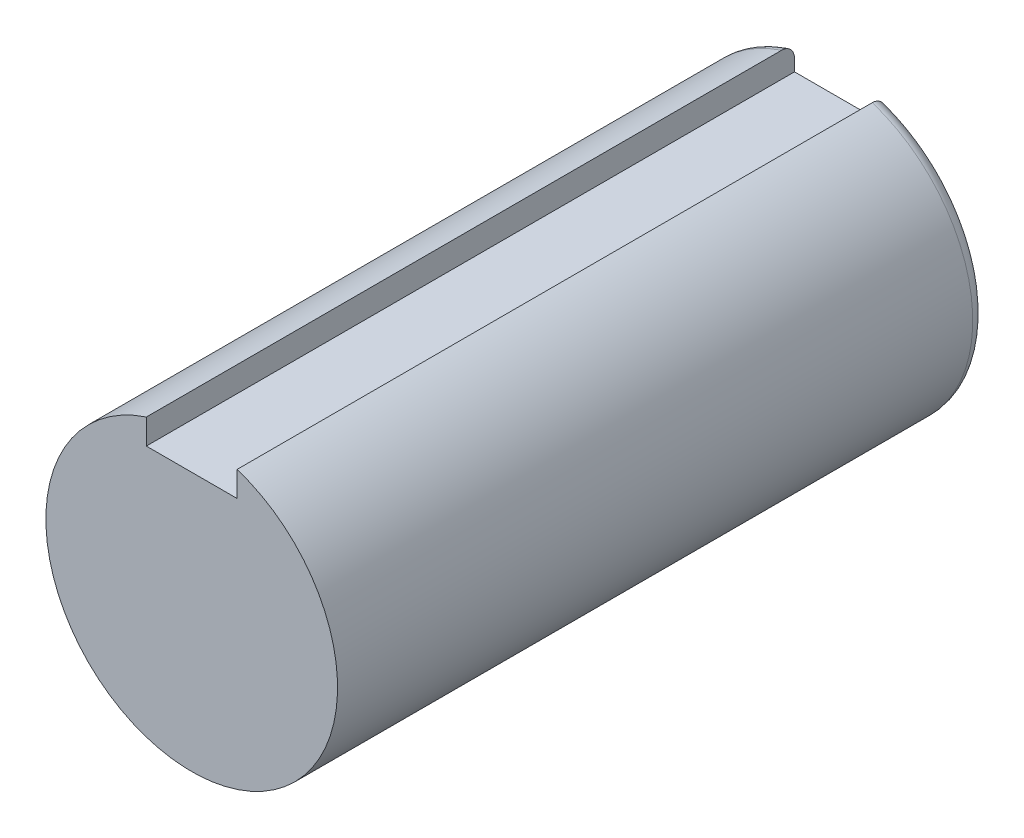
ISO-10303-21;
HEADER;
FILE_DESCRIPTION(('STEP AP214'),'2;1');
FILE_NAME('part.step','',(''),(''),'','','');
FILE_SCHEMA(('AUTOMOTIVE_DESIGN { 1 0 10303 214 1 1 1 1 }'));
ENDSEC;
DATA;
#1=APPLICATION_CONTEXT('core data for automotive mechanical design processes');
#2=APPLICATION_PROTOCOL_DEFINITION('international standard','automotive_design',2000,#1);
#3=PRODUCT_CONTEXT('',#1,'mechanical');
#4=PRODUCT('Part','Part','',(#3));
#5=PRODUCT_RELATED_PRODUCT_CATEGORY('part','',(#4));
#6=PRODUCT_DEFINITION_FORMATION('','',#4);
#7=PRODUCT_DEFINITION_CONTEXT('part definition',#1,'design');
#8=PRODUCT_DEFINITION('design','',#6,#7);
#9=PRODUCT_DEFINITION_SHAPE('','',#8);
#10=(LENGTH_UNIT() NAMED_UNIT(*) SI_UNIT(.MILLI.,.METRE.));
#11=(NAMED_UNIT(*) PLANE_ANGLE_UNIT() SI_UNIT($,.RADIAN.));
#12=(NAMED_UNIT(*) SI_UNIT($,.STERADIAN.) SOLID_ANGLE_UNIT());
#13=UNCERTAINTY_MEASURE_WITH_UNIT(LENGTH_MEASURE(1.E-05),#10,'distance_accuracy_value','');
#14=(GEOMETRIC_REPRESENTATION_CONTEXT(3) GLOBAL_UNCERTAINTY_ASSIGNED_CONTEXT((#13)) GLOBAL_UNIT_ASSIGNED_CONTEXT((#10,
#11,#12)) REPRESENTATION_CONTEXT('',''));
#15=CARTESIAN_POINT('',(0.,0.,0.));
#16=DIRECTION('',(0.,0.,1.));
#17=DIRECTION('',(1.,0.,0.));
#18=AXIS2_PLACEMENT_3D('',#15,#16,#17);
#19=CARTESIAN_POINT('',(0.,0.,100.));
#20=DIRECTION('',(0.,0.,-1.));
#21=DIRECTION('',(-1.,0.,0.));
#22=AXIS2_PLACEMENT_3D('',#19,#20,#21);
#23=CYLINDRICAL_SURFACE('',#22,22.5);
#24=DIRECTION('',(0.,0.,-1.));
#25=VECTOR('',#24,1.);
#26=CARTESIAN_POINT('',(-7.,21.3834047803431,100.));
#27=LINE('',#26,#25);
#28=CARTESIAN_POINT('',(-7.,21.3834047803431,100.));
#29=VERTEX_POINT('',#28);
#30=CARTESIAN_POINT('',(-7.,21.3834047803431,2.));
#31=VERTEX_POINT('',#30);
#32=EDGE_CURVE('E128',#29,#31,#27,.T.);
#33=ORIENTED_EDGE('',*,*,#32,.T.);
#34=CARTESIAN_POINT('',(0.,0.,2.));
#35=DIRECTION('',(0.,0.,1.));
#36=DIRECTION('',(1.,0.,0.));
#37=AXIS2_PLACEMENT_3D('',#34,#35,#36);
#38=CIRCLE('',#37,22.5);
#39=CARTESIAN_POINT('',(7.,21.3834047803431,2.));
#40=VERTEX_POINT('',#39);
#41=EDGE_CURVE('E140',#31,#40,#38,.T.);
#42=ORIENTED_EDGE('',*,*,#41,.T.);
#43=DIRECTION('',(0.,0.,-1.));
#44=VECTOR('',#43,1.);
#45=CARTESIAN_POINT('',(7.,21.3834047803431,100.));
#46=LINE('',#45,#44);
#47=CARTESIAN_POINT('',(7.,21.3834047803431,100.));
#48=VERTEX_POINT('',#47);
#49=EDGE_CURVE('E133',#40,#48,#46,.F.);
#50=ORIENTED_EDGE('',*,*,#49,.T.);
#51=CARTESIAN_POINT('',(0.,0.,100.));
#52=DIRECTION('',(0.,0.,1.));
#53=DIRECTION('',(1.,0.,0.));
#54=AXIS2_PLACEMENT_3D('',#51,#52,#53);
#55=CIRCLE('',#54,22.5);
#56=EDGE_CURVE('E115',#29,#48,#55,.T.);
#57=ORIENTED_EDGE('',*,*,#56,.F.);
#58=EDGE_LOOP('',(#33,#42,#50,#57));
#59=FACE_BOUND('',#58,.T.);
#60=ADVANCED_FACE('F39',(#59),#23,.T.);
#61=CARTESIAN_POINT('',(0.,0.,100.));
#62=DIRECTION('',(0.,0.,1.));
#63=DIRECTION('',(1.,0.,0.));
#64=AXIS2_PLACEMENT_3D('',#61,#62,#63);
#65=PLANE('',#64);
#66=DIRECTION('',(0.,-1.,0.));
#67=VECTOR('',#66,1.);
#68=CARTESIAN_POINT('',(7.,25.3009858484922,100.));
#69=LINE('',#68,#67);
#70=CARTESIAN_POINT('',(7.,17.5,100.));
#71=VERTEX_POINT('',#70);
#72=EDGE_CURVE('E95',#48,#71,#69,.T.);
#73=ORIENTED_EDGE('',*,*,#72,.T.);
#74=DIRECTION('',(-1.,0.,0.));
#75=VECTOR('',#74,1.);
#76=CARTESIAN_POINT('',(7.,17.5,100.));
#77=LINE('',#76,#75);
#78=CARTESIAN_POINT('',(-7.,17.5,100.));
#79=VERTEX_POINT('',#78);
#80=EDGE_CURVE('E106',#71,#79,#77,.T.);
#81=ORIENTED_EDGE('',*,*,#80,.T.);
#82=DIRECTION('',(0.,1.,0.));
#83=VECTOR('',#82,1.);
#84=CARTESIAN_POINT('',(-7.,25.3009858484922,100.));
#85=LINE('',#84,#83);
#86=EDGE_CURVE('E103',#79,#29,#85,.T.);
#87=ORIENTED_EDGE('',*,*,#86,.T.);
#88=ORIENTED_EDGE('',*,*,#56,.T.);
#89=EDGE_LOOP('',(#73,#81,#87,#88));
#90=FACE_BOUND('',#89,.T.);
#91=ADVANCED_FACE('F113',(#90),#65,.T.);
#92=CARTESIAN_POINT('',(0.,0.,0.));
#93=DIRECTION('',(0.,0.,1.));
#94=DIRECTION('',(1.,0.,0.));
#95=AXIS2_PLACEMENT_3D('',#92,#93,#94);
#96=PLANE('',#95);
#97=DIRECTION('',(0.,1.,0.));
#98=VECTOR('',#97,1.);
#99=CARTESIAN_POINT('',(7.,0.,0.));
#100=LINE('',#99,#98);
#101=CARTESIAN_POINT('',(7.,17.5,0.));
#102=VERTEX_POINT('',#101);
#103=CARTESIAN_POINT('',(7.,19.2678488679977,0.));
#104=VERTEX_POINT('',#103);
#105=EDGE_CURVE('E97',#102,#104,#100,.T.);
#106=ORIENTED_EDGE('',*,*,#105,.T.);
#107=CARTESIAN_POINT('',(0.,0.,0.));
#108=DIRECTION('',(0.,0.,1.));
#109=DIRECTION('',(1.,0.,0.));
#110=AXIS2_PLACEMENT_3D('',#107,#108,#109);
#111=CIRCLE('',#110,20.5);
#112=CARTESIAN_POINT('',(-7.,19.2678488679977,0.));
#113=VERTEX_POINT('',#112);
#114=EDGE_CURVE('E54',#104,#113,#111,.F.);
#115=ORIENTED_EDGE('',*,*,#114,.T.);
#116=DIRECTION('',(0.,1.,0.));
#117=VECTOR('',#116,1.);
#118=CARTESIAN_POINT('',(-7.,25.3009858484922,0.));
#119=LINE('',#118,#117);
#120=CARTESIAN_POINT('',(-7.,17.5,0.));
#121=VERTEX_POINT('',#120);
#122=EDGE_CURVE('E117',#121,#113,#119,.T.);
#123=ORIENTED_EDGE('',*,*,#122,.F.);
#124=DIRECTION('',(-1.,0.,0.));
#125=VECTOR('',#124,1.);
#126=CARTESIAN_POINT('',(7.,17.5,0.));
#127=LINE('',#126,#125);
#128=EDGE_CURVE('E120',#102,#121,#127,.T.);
#129=ORIENTED_EDGE('',*,*,#128,.F.);
#130=EDGE_LOOP('',(#106,#115,#123,#129));
#131=FACE_BOUND('',#130,.T.);
#132=ADVANCED_FACE('F155',(#131),#96,.F.);
#133=CARTESIAN_POINT('',(7.,25.3009858484922,100.));
#134=DIRECTION('',(1.,0.,0.));
#135=DIRECTION('',(0.,1.,0.));
#136=AXIS2_PLACEMENT_3D('',#133,#134,#135);
#137=PLANE('',#136);
#138=ORIENTED_EDGE('',*,*,#49,.F.);
#139=CARTESIAN_POINT('',(7.,21.3834047803431,2.));
#140=CARTESIAN_POINT('',(7.,21.3834057365706,1.94580397332455));
#141=CARTESIAN_POINT('',(7.,21.3810852740131,1.89163459577142));
#142=CARTESIAN_POINT('',(7.,21.3718370272674,1.7836981475179));
#143=CARTESIAN_POINT('',(7.,21.3649098887404,1.72993102150663));
#144=CARTESIAN_POINT('',(7.,21.3373246374997,1.57004596384185));
#145=CARTESIAN_POINT('',(7.,21.3098622048427,1.46502333642817));
#146=CARTESIAN_POINT('',(7.,21.2377588715982,1.26112407958104));
#147=CARTESIAN_POINT('',(7.,21.1931174054291,1.16224765262212));
#148=CARTESIAN_POINT('',(7.,21.0881747394594,0.973172132956409));
#149=CARTESIAN_POINT('',(7.,21.0278705964098,0.882974675527115));
#150=CARTESIAN_POINT('',(7.,20.8922159535047,0.711809138772351));
#151=CARTESIAN_POINT('',(7.,20.8165924490621,0.631057877673417));
#152=CARTESIAN_POINT('',(7.,20.6534052330804,0.48269842613843));
#153=CARTESIAN_POINT('',(7.,20.5658389767242,0.415093044355179));
#154=CARTESIAN_POINT('',(7.,20.3768797896561,0.291515616978087));
#155=CARTESIAN_POINT('',(7.,20.2750288800019,0.236244718037179));
#156=CARTESIAN_POINT('',(7.,20.0638140320751,0.142609495853022));
#157=CARTESIAN_POINT('',(7.,19.9544481881615,0.104249479303513));
#158=CARTESIAN_POINT('',(7.,19.7490453458064,0.0497889745034796));
#159=CARTESIAN_POINT('',(7.,19.6536808023271,0.0311065391764888));
#160=CARTESIAN_POINT('',(7.,19.4614945676482,0.00621194200257935));
#161=CARTESIAN_POINT('',(7.,19.364675522059,-2.06166073194617E-05));
#162=CARTESIAN_POINT('',(7.,19.2678488679977,0.));
#163=B_SPLINE_CURVE_WITH_KNOTS('',3,(#139,#140,#141,#142,#143,#144,#145,#146,#147,#148,#149,
#150,#151,#152,#153,#154,#155,#156,#157,#158,#159,#160,#161,#162),.UNSPECIFIED.,.F.,.F.,(4,2,2,
2,2,2,2,2,2,2,2,4),(0.,0.162485855174599,0.324948941496128,0.648924606770374,0.97291093913841,
1.29695819744277,1.62738905356502,1.957890429754,2.30401786619257,2.65023340004134,
2.94096979535452,3.2312294822559),.UNSPECIFIED.);
#164=EDGE_CURVE('E68',#40,#104,#163,.T.);
#165=ORIENTED_EDGE('',*,*,#164,.T.);
#166=ORIENTED_EDGE('',*,*,#105,.F.);
#167=DIRECTION('',(0.,0.,-1.));
#168=VECTOR('',#167,1.);
#169=CARTESIAN_POINT('',(7.,17.5,100.));
#170=LINE('',#169,#168);
#171=EDGE_CURVE('E91',#71,#102,#170,.T.);
#172=ORIENTED_EDGE('',*,*,#171,.F.);
#173=ORIENTED_EDGE('',*,*,#72,.F.);
#174=EDGE_LOOP('',(#138,#165,#166,#172,#173));
#175=FACE_BOUND('',#174,.T.);
#176=ADVANCED_FACE('F93',(#175),#137,.F.);
#177=CARTESIAN_POINT('',(-7.,25.3009858484922,100.));
#178=DIRECTION('',(-1.,0.,0.));
#179=DIRECTION('',(0.,-1.,0.));
#180=AXIS2_PLACEMENT_3D('',#177,#178,#179);
#181=PLANE('',#180);
#182=ORIENTED_EDGE('',*,*,#122,.T.);
#183=CARTESIAN_POINT('',(-7.,19.2678488679977,0.));
#184=CARTESIAN_POINT('',(-7.,19.3301499253215,2.38232895408798E-06));
#185=CARTESIAN_POINT('',(-7.,19.392423162825,0.00257318081211734));
#186=CARTESIAN_POINT('',(-7.,19.5165506516808,0.0128599448424561));
#187=CARTESIAN_POINT('',(-7.,19.5784048488102,0.020576563872654));
#188=CARTESIAN_POINT('',(-7.,19.7628198619563,0.0514650440388661));
#189=CARTESIAN_POINT('',(-7.,19.8841818582438,0.0823755410363677));
#190=CARTESIAN_POINT('',(-7.,20.120024526014,0.164395328280201));
#191=CARTESIAN_POINT('',(-7.,20.2344956305417,0.215531986754237));
#192=CARTESIAN_POINT('',(-7.,20.4527237487754,0.336964326795638));
#193=CARTESIAN_POINT('',(-7.,20.5564896640412,0.407243910719723));
#194=CARTESIAN_POINT('',(-7.,20.7462958744666,0.562467162191712));
#195=CARTESIAN_POINT('',(-7.,20.8328361716501,0.646798807449662));
#196=CARTESIAN_POINT('',(-7.,20.9895580017951,0.829570073267646));
#197=CARTESIAN_POINT('',(-7.,21.0597385539924,0.9280105390784));
#198=CARTESIAN_POINT('',(-7.,21.1776576563144,1.13037121750746));
#199=CARTESIAN_POINT('',(-7.,21.2264086673754,1.23370277009462));
#200=CARTESIAN_POINT('',(-7.,21.3049212880538,1.44727767123461));
#201=CARTESIAN_POINT('',(-7.,21.3347090559289,1.55751126727013));
#202=CARTESIAN_POINT('',(-7.,21.3640862465992,1.723992702747));
#203=CARTESIAN_POINT('',(-7.,21.3713285490914,1.77898643425709));
#204=CARTESIAN_POINT('',(-7.,21.3809842791911,1.88931055065759));
#205=CARTESIAN_POINT('',(-7.,21.3834051453238,1.94464028465284));
#206=CARTESIAN_POINT('',(-7.,21.3834047803431,2.));
#207=B_SPLINE_CURVE_WITH_KNOTS('',3,(#183,#184,#185,#186,#187,#188,#189,#190,#191,#192,#193,
#194,#195,#196,#197,#198,#199,#200,#201,#202,#203,#204,#205,#206),.UNSPECIFIED.,.F.,.F.,(4,2,2,
2,2,2,2,2,2,2,2,4),(0.,0.186793540598891,0.373610807182446,0.747397164051056,1.12169103490579,
1.49567112163127,1.85632019056976,2.2169908748096,2.5580579864814,2.89865359840584,
3.0648773309562,3.23084441379858),.UNSPECIFIED.);
#208=EDGE_CURVE('E11',#113,#31,#207,.T.);
#209=ORIENTED_EDGE('',*,*,#208,.T.);
#210=ORIENTED_EDGE('',*,*,#32,.F.);
#211=ORIENTED_EDGE('',*,*,#86,.F.);
#212=DIRECTION('',(0.,0.,-1.));
#213=VECTOR('',#212,1.);
#214=CARTESIAN_POINT('',(-7.,17.5,100.));
#215=LINE('',#214,#213);
#216=EDGE_CURVE('E102',#79,#121,#215,.T.);
#217=ORIENTED_EDGE('',*,*,#216,.T.);
#218=EDGE_LOOP('',(#182,#209,#210,#211,#217));
#219=FACE_BOUND('',#218,.T.);
#220=ADVANCED_FACE('F154',(#219),#181,.F.);
#221=CARTESIAN_POINT('',(7.,17.5,100.));
#222=DIRECTION('',(0.,-1.,0.));
#223=DIRECTION('',(0.,0.,-1.));
#224=AXIS2_PLACEMENT_3D('',#221,#222,#223);
#225=PLANE('',#224);
#226=ORIENTED_EDGE('',*,*,#128,.T.);
#227=ORIENTED_EDGE('',*,*,#216,.F.);
#228=ORIENTED_EDGE('',*,*,#80,.F.);
#229=ORIENTED_EDGE('',*,*,#171,.T.);
#230=EDGE_LOOP('',(#226,#227,#228,#229));
#231=FACE_BOUND('',#230,.T.);
#232=ADVANCED_FACE('F107',(#231),#225,.F.);
#233=CARTESIAN_POINT('',(0.,0.,2.));
#234=DIRECTION('',(0.,0.,1.));
#235=DIRECTION('',(1.,0.,0.));
#236=AXIS2_PLACEMENT_3D('',#233,#234,#235);
#237=TOROIDAL_SURFACE('',#236,20.5,2.);
#238=ORIENTED_EDGE('',*,*,#208,.F.);
#239=ORIENTED_EDGE('',*,*,#114,.F.);
#240=ORIENTED_EDGE('',*,*,#164,.F.);
#241=ORIENTED_EDGE('',*,*,#41,.F.);
#242=EDGE_LOOP('',(#238,#239,#240,#241));
#243=FACE_BOUND('',#242,.T.);
#244=ADVANCED_FACE('F41',(#243),#237,.T.);
#245=CLOSED_SHELL('',(#60,#91,#132,#176,#220,#232,#244));
#246=MANIFOLD_SOLID_BREP('B2',#245);
#247=ADVANCED_BREP_SHAPE_REPRESENTATION('',(#18,#246),#14);
#248=SHAPE_DEFINITION_REPRESENTATION(#9,#247);
ENDSEC;
END-ISO-10303-21;
